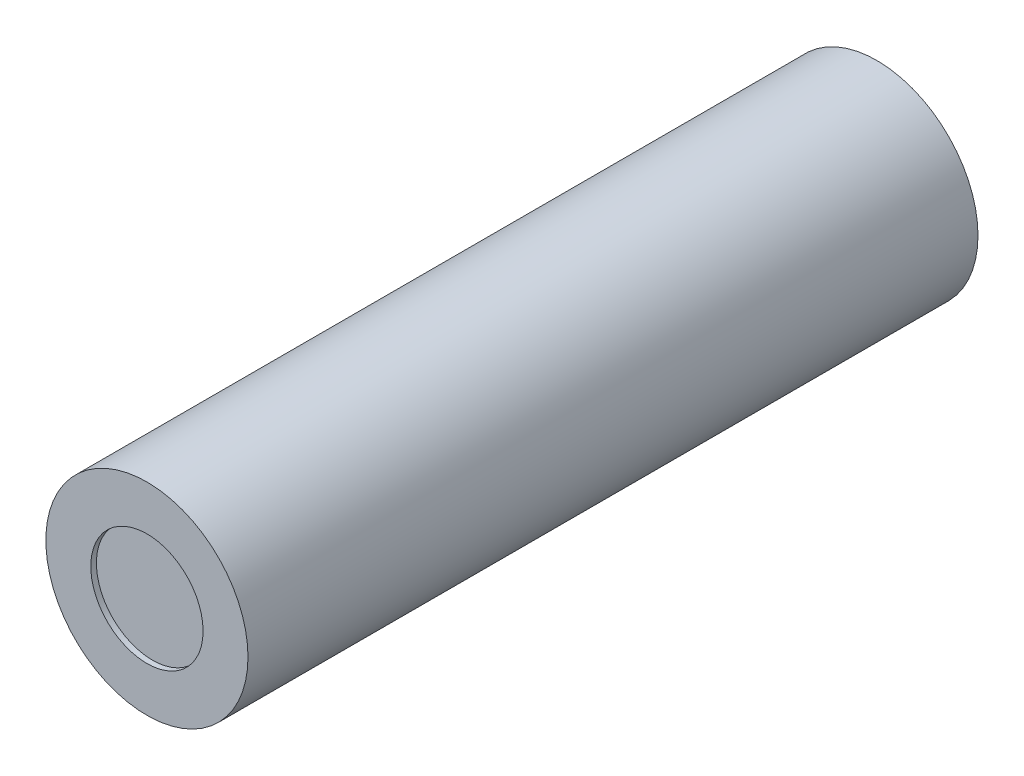
ISO-10303-21;
HEADER;
FILE_DESCRIPTION(('STEP AP214'),'2;1');
FILE_NAME('part.step','',(''),(''),'','','');
FILE_SCHEMA(('AUTOMOTIVE_DESIGN { 1 0 10303 214 1 1 1 1 }'));
ENDSEC;
DATA;
#1=APPLICATION_CONTEXT('core data for automotive mechanical design processes');
#2=APPLICATION_PROTOCOL_DEFINITION('international standard','automotive_design',2000,#1);
#3=PRODUCT_CONTEXT('',#1,'mechanical');
#4=PRODUCT('Part','Part','',(#3));
#5=PRODUCT_RELATED_PRODUCT_CATEGORY('part','',(#4));
#6=PRODUCT_DEFINITION_FORMATION('','',#4);
#7=PRODUCT_DEFINITION_CONTEXT('part definition',#1,'design');
#8=PRODUCT_DEFINITION('design','',#6,#7);
#9=PRODUCT_DEFINITION_SHAPE('','',#8);
#10=(LENGTH_UNIT() NAMED_UNIT(*) SI_UNIT(.MILLI.,.METRE.));
#11=(NAMED_UNIT(*) PLANE_ANGLE_UNIT() SI_UNIT($,.RADIAN.));
#12=(NAMED_UNIT(*) SI_UNIT($,.STERADIAN.) SOLID_ANGLE_UNIT());
#13=UNCERTAINTY_MEASURE_WITH_UNIT(LENGTH_MEASURE(1.E-05),#10,'distance_accuracy_value','');
#14=(GEOMETRIC_REPRESENTATION_CONTEXT(3) GLOBAL_UNCERTAINTY_ASSIGNED_CONTEXT((#13)) GLOBAL_UNIT_ASSIGNED_CONTEXT((#10,
#11,#12)) REPRESENTATION_CONTEXT('',''));
#15=CARTESIAN_POINT('',(0.,0.,0.));
#16=DIRECTION('',(0.,0.,1.));
#17=DIRECTION('',(1.,0.,0.));
#18=AXIS2_PLACEMENT_3D('',#15,#16,#17);
#19=CARTESIAN_POINT('',(0.,0.,65.));
#20=DIRECTION('',(0.,0.,-1.));
#21=DIRECTION('',(-1.,0.,0.));
#22=AXIS2_PLACEMENT_3D('',#19,#20,#21);
#23=CYLINDRICAL_SURFACE('',#22,9.);
#24=CARTESIAN_POINT('',(0.,0.,65.));
#25=DIRECTION('',(0.,0.,1.));
#26=DIRECTION('',(1.,0.,0.));
#27=AXIS2_PLACEMENT_3D('',#24,#25,#26);
#28=CIRCLE('',#27,9.);
#29=CARTESIAN_POINT('',(9.,0.,65.));
#30=VERTEX_POINT('',#29);
#31=EDGE_CURVE('E10',#30,#30,#28,.T.);
#32=ORIENTED_EDGE('',*,*,#31,.F.);
#33=EDGE_LOOP('',(#32));
#34=FACE_BOUND('',#33,.T.);
#35=CARTESIAN_POINT('',(0.,0.,0.));
#36=DIRECTION('',(0.,0.,1.));
#37=DIRECTION('',(1.,0.,0.));
#38=AXIS2_PLACEMENT_3D('',#35,#36,#37);
#39=CIRCLE('',#38,9.);
#40=CARTESIAN_POINT('',(9.,0.,0.));
#41=VERTEX_POINT('',#40);
#42=EDGE_CURVE('E42',#41,#41,#39,.T.);
#43=ORIENTED_EDGE('',*,*,#42,.T.);
#44=EDGE_LOOP('',(#43));
#45=FACE_BOUND('',#44,.T.);
#46=ADVANCED_FACE('F39',(#34,#45),#23,.T.);
#47=CARTESIAN_POINT('',(0.,0.,65.));
#48=DIRECTION('',(0.,0.,1.));
#49=DIRECTION('',(1.,0.,0.));
#50=AXIS2_PLACEMENT_3D('',#47,#48,#49);
#51=PLANE('',#50);
#52=CARTESIAN_POINT('',(0.,0.,65.));
#53=DIRECTION('',(0.,0.,1.));
#54=DIRECTION('',(1.,0.,0.));
#55=AXIS2_PLACEMENT_3D('',#52,#53,#54);
#56=CIRCLE('',#55,5.);
#57=CARTESIAN_POINT('',(5.,0.,65.));
#58=VERTEX_POINT('',#57);
#59=EDGE_CURVE('E61',#58,#58,#56,.T.);
#60=ORIENTED_EDGE('',*,*,#59,.F.);
#61=EDGE_LOOP('',(#60));
#62=FACE_BOUND('',#61,.T.);
#63=ORIENTED_EDGE('',*,*,#31,.T.);
#64=EDGE_LOOP('',(#63));
#65=FACE_BOUND('',#64,.T.);
#66=ADVANCED_FACE('F78',(#62,#65),#51,.T.);
#67=CARTESIAN_POINT('',(0.,0.,0.));
#68=DIRECTION('',(0.,0.,1.));
#69=DIRECTION('',(1.,0.,0.));
#70=AXIS2_PLACEMENT_3D('',#67,#68,#69);
#71=PLANE('',#70);
#72=CARTESIAN_POINT('',(0.,0.,0.));
#73=DIRECTION('',(0.,0.,1.));
#74=DIRECTION('',(1.,0.,0.));
#75=AXIS2_PLACEMENT_3D('',#72,#73,#74);
#76=CIRCLE('',#75,7.);
#77=CARTESIAN_POINT('',(7.,0.,0.));
#78=VERTEX_POINT('',#77);
#79=EDGE_CURVE('E53',#78,#78,#76,.T.);
#80=ORIENTED_EDGE('',*,*,#79,.T.);
#81=EDGE_LOOP('',(#80));
#82=FACE_BOUND('',#81,.T.);
#83=ORIENTED_EDGE('',*,*,#42,.F.);
#84=EDGE_LOOP('',(#83));
#85=FACE_BOUND('',#84,.T.);
#86=ADVANCED_FACE('F80',(#82,#85),#71,.F.);
#87=CARTESIAN_POINT('',(0.,0.,0.5));
#88=DIRECTION('',(0.,0.,-1.));
#89=DIRECTION('',(-1.,0.,0.));
#90=AXIS2_PLACEMENT_3D('',#87,#88,#89);
#91=CYLINDRICAL_SURFACE('',#90,7.);
#92=CARTESIAN_POINT('',(0.,0.,0.5));
#93=DIRECTION('',(0.,0.,1.));
#94=DIRECTION('',(1.,0.,0.));
#95=AXIS2_PLACEMENT_3D('',#92,#93,#94);
#96=CIRCLE('',#95,7.);
#97=CARTESIAN_POINT('',(7.,0.,0.5));
#98=VERTEX_POINT('',#97);
#99=EDGE_CURVE('E51',#98,#98,#96,.T.);
#100=ORIENTED_EDGE('',*,*,#99,.T.);
#101=EDGE_LOOP('',(#100));
#102=FACE_BOUND('',#101,.T.);
#103=ORIENTED_EDGE('',*,*,#79,.F.);
#104=EDGE_LOOP('',(#103));
#105=FACE_BOUND('',#104,.T.);
#106=ADVANCED_FACE('F86',(#102,#105),#91,.F.);
#107=CARTESIAN_POINT('',(0.,0.,0.5));
#108=DIRECTION('',(0.,0.,1.));
#109=DIRECTION('',(1.,0.,0.));
#110=AXIS2_PLACEMENT_3D('',#107,#108,#109);
#111=PLANE('',#110);
#112=ORIENTED_EDGE('',*,*,#99,.F.);
#113=EDGE_LOOP('',(#112));
#114=FACE_BOUND('',#113,.T.);
#115=ADVANCED_FACE('F74',(#114),#111,.F.);
#116=CARTESIAN_POINT('',(0.,0.,64.5));
#117=DIRECTION('',(0.,0.,1.));
#118=DIRECTION('',(1.,0.,0.));
#119=AXIS2_PLACEMENT_3D('',#116,#117,#118);
#120=CYLINDRICAL_SURFACE('',#119,5.);
#121=CARTESIAN_POINT('',(0.,0.,64.5));
#122=DIRECTION('',(0.,0.,1.));
#123=DIRECTION('',(1.,0.,0.));
#124=AXIS2_PLACEMENT_3D('',#121,#122,#123);
#125=CIRCLE('',#124,5.);
#126=CARTESIAN_POINT('',(5.,0.,64.5));
#127=VERTEX_POINT('',#126);
#128=EDGE_CURVE('E57',#127,#127,#125,.T.);
#129=ORIENTED_EDGE('',*,*,#128,.F.);
#130=EDGE_LOOP('',(#129));
#131=FACE_BOUND('',#130,.T.);
#132=ORIENTED_EDGE('',*,*,#59,.T.);
#133=EDGE_LOOP('',(#132));
#134=FACE_BOUND('',#133,.T.);
#135=ADVANCED_FACE('F71',(#131,#134),#120,.F.);
#136=CARTESIAN_POINT('',(0.,0.,64.5));
#137=DIRECTION('',(0.,0.,1.));
#138=DIRECTION('',(1.,0.,0.));
#139=AXIS2_PLACEMENT_3D('',#136,#137,#138);
#140=PLANE('',#139);
#141=ORIENTED_EDGE('',*,*,#128,.T.);
#142=EDGE_LOOP('',(#141));
#143=FACE_BOUND('',#142,.T.);
#144=ADVANCED_FACE('F69',(#143),#140,.T.);
#145=CLOSED_SHELL('',(#46,#66,#86,#106,#115,#135,#144));
#146=MANIFOLD_SOLID_BREP('B2',#145);
#147=ADVANCED_BREP_SHAPE_REPRESENTATION('',(#18,#146),#14);
#148=SHAPE_DEFINITION_REPRESENTATION(#9,#147);
ENDSEC;
END-ISO-10303-21;
